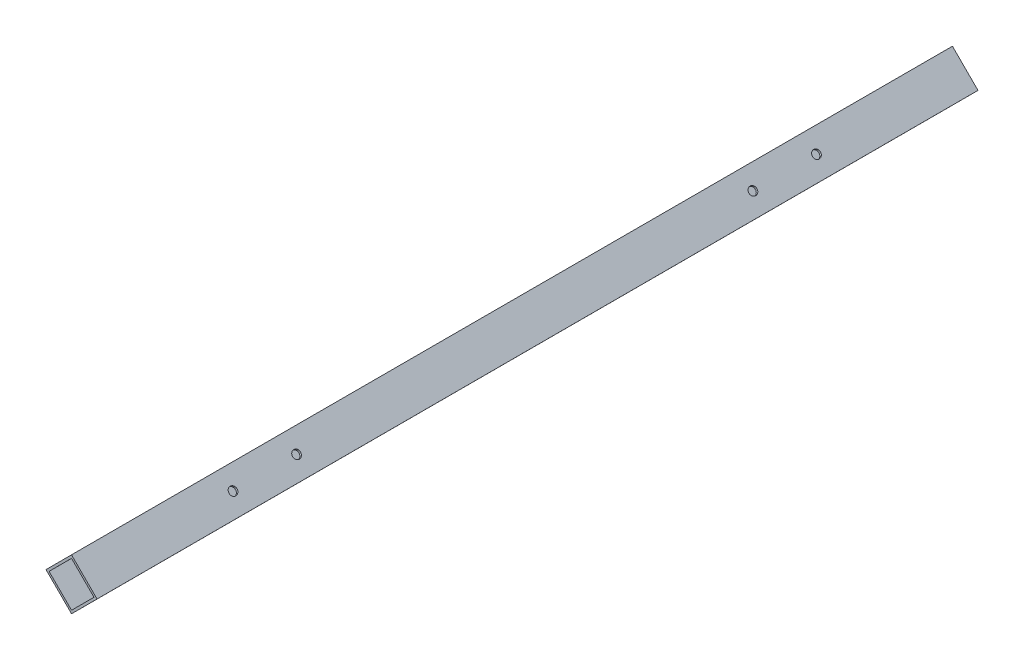
ISO-10303-21;
HEADER;
FILE_DESCRIPTION(('STEP AP214'),'2;1');
FILE_NAME('part.step','',(''),(''),'','','');
FILE_SCHEMA(('AUTOMOTIVE_DESIGN { 1 0 10303 214 1 1 1 1 }'));
ENDSEC;
DATA;
#1=APPLICATION_CONTEXT('core data for automotive mechanical design processes');
#2=APPLICATION_PROTOCOL_DEFINITION('international standard','automotive_design',2000,#1);
#3=PRODUCT_CONTEXT('',#1,'mechanical');
#4=PRODUCT('Part','Part','',(#3));
#5=PRODUCT_RELATED_PRODUCT_CATEGORY('part','',(#4));
#6=PRODUCT_DEFINITION_FORMATION('','',#4);
#7=PRODUCT_DEFINITION_CONTEXT('part definition',#1,'design');
#8=PRODUCT_DEFINITION('design','',#6,#7);
#9=PRODUCT_DEFINITION_SHAPE('','',#8);
#10=(LENGTH_UNIT() NAMED_UNIT(*) SI_UNIT(.MILLI.,.METRE.));
#11=(NAMED_UNIT(*) PLANE_ANGLE_UNIT() SI_UNIT($,.RADIAN.));
#12=(NAMED_UNIT(*) SI_UNIT($,.STERADIAN.) SOLID_ANGLE_UNIT());
#13=UNCERTAINTY_MEASURE_WITH_UNIT(LENGTH_MEASURE(1.E-05),#10,'distance_accuracy_value','');
#14=(GEOMETRIC_REPRESENTATION_CONTEXT(3) GLOBAL_UNCERTAINTY_ASSIGNED_CONTEXT((#13)) GLOBAL_UNIT_ASSIGNED_CONTEXT((#10,
#11,#12)) REPRESENTATION_CONTEXT('',''));
#15=CARTESIAN_POINT('',(0.,0.,0.));
#16=DIRECTION('',(0.,0.,1.));
#17=DIRECTION('',(1.,0.,0.));
#18=AXIS2_PLACEMENT_3D('',#15,#16,#17);
#19=CARTESIAN_POINT('',(0.,0.,610.));
#20=DIRECTION('',(0.,0.,1.));
#21=DIRECTION('',(1.,0.,0.));
#22=AXIS2_PLACEMENT_3D('',#19,#20,#21);
#23=PLANE('',#22);
#24=DIRECTION('',(-0.70646122875546,-0.707751744798503,0.));
#25=VECTOR('',#24,1.);
#26=CARTESIAN_POINT('',(0.,0.,610.));
#27=LINE('',#26,#25);
#28=CARTESIAN_POINT('',(0.,0.,610.));
#29=VERTEX_POINT('',#28);
#30=CARTESIAN_POINT('',(-17.6615307188865,-17.6937936199626,610.));
#31=VERTEX_POINT('',#30);
#32=EDGE_CURVE('E139',#29,#31,#27,.T.);
#33=ORIENTED_EDGE('',*,*,#32,.T.);
#34=DIRECTION('',(0.707751744798503,-0.70646122875546,0.));
#35=VECTOR('',#34,1.);
#36=CARTESIAN_POINT('',(-17.6615307188865,-17.6937936199626,610.));
#37=LINE('',#36,#35);
#38=CARTESIAN_POINT('',(0.0322629010760627,-35.3553243388491,610.));
#39=VERTEX_POINT('',#38);
#40=EDGE_CURVE('E142',#31,#39,#37,.T.);
#41=ORIENTED_EDGE('',*,*,#40,.T.);
#42=DIRECTION('',(0.70646122875546,0.707751744798503,0.));
#43=VECTOR('',#42,1.);
#44=CARTESIAN_POINT('',(17.6937936199626,-17.6615307188865,610.));
#45=LINE('',#44,#43);
#46=CARTESIAN_POINT('',(17.6937936199626,-17.6615307188865,610.));
#47=VERTEX_POINT('',#46);
#48=EDGE_CURVE('E145',#39,#47,#45,.T.);
#49=ORIENTED_EDGE('',*,*,#48,.T.);
#50=DIRECTION('',(-0.707751744798503,0.70646122875546,0.));
#51=VECTOR('',#50,1.);
#52=CARTESIAN_POINT('',(0.,0.,610.));
#53=LINE('',#52,#51);
#54=EDGE_CURVE('E147',#47,#29,#53,.T.);
#55=ORIENTED_EDGE('',*,*,#54,.T.);
#56=EDGE_LOOP('',(#33,#41,#49,#55));
#57=FACE_BOUND('',#56,.T.);
#58=DIRECTION('',(-0.706461228755461,-0.707751744798503,0.));
#59=VECTOR('',#58,1.);
#60=CARTESIAN_POINT('',(0.00193577406456353,-2.12131946033095,610.));
#61=LINE('',#60,#59);
#62=CARTESIAN_POINT('',(0.00193577406456353,-2.12131946033095,610.));
#63=VERTEX_POINT('',#62);
#64=CARTESIAN_POINT('',(-15.5402112585556,-17.691857845898,610.));
#65=VERTEX_POINT('',#64);
#66=EDGE_CURVE('E109',#63,#65,#61,.T.);
#67=ORIENTED_EDGE('',*,*,#66,.F.);
#68=DIRECTION('',(-0.707751744798503,0.70646122875546,0.));
#69=VECTOR('',#68,1.);
#70=CARTESIAN_POINT('',(0.00193577406456353,-2.12131946033095,610.));
#71=LINE('',#70,#69);
#72=CARTESIAN_POINT('',(15.5724741596316,-17.6634664929511,610.));
#73=VERTEX_POINT('',#72);
#74=EDGE_CURVE('E101',#73,#63,#71,.T.);
#75=ORIENTED_EDGE('',*,*,#74,.F.);
#76=DIRECTION('',(0.70646122875546,0.707751744798503,0.));
#77=VECTOR('',#76,1.);
#78=CARTESIAN_POINT('',(15.5724741596316,-17.6634664929511,610.));
#79=LINE('',#78,#77);
#80=CARTESIAN_POINT('',(0.0303271270114952,-33.2340048785181,610.));
#81=VERTEX_POINT('',#80);
#82=EDGE_CURVE('E123',#81,#73,#79,.T.);
#83=ORIENTED_EDGE('',*,*,#82,.F.);
#84=DIRECTION('',(0.707751744798503,-0.70646122875546,0.));
#85=VECTOR('',#84,1.);
#86=CARTESIAN_POINT('',(-15.5402112585556,-17.691857845898,610.));
#87=LINE('',#86,#85);
#88=EDGE_CURVE('E121',#65,#81,#87,.T.);
#89=ORIENTED_EDGE('',*,*,#88,.F.);
#90=EDGE_LOOP('',(#67,#75,#83,#89));
#91=FACE_BOUND('',#90,.T.);
#92=ADVANCED_FACE('F34',(#57,#91),#23,.T.);
#93=CARTESIAN_POINT('',(0.,0.,0.));
#94=DIRECTION('',(0.,0.,1.));
#95=DIRECTION('',(1.,0.,0.));
#96=AXIS2_PLACEMENT_3D('',#93,#94,#95);
#97=PLANE('',#96);
#98=DIRECTION('',(-0.70646122875546,-0.707751744798503,0.));
#99=VECTOR('',#98,1.);
#100=CARTESIAN_POINT('',(0.,0.,0.));
#101=LINE('',#100,#99);
#102=CARTESIAN_POINT('',(0.,0.,0.));
#103=VERTEX_POINT('',#102);
#104=CARTESIAN_POINT('',(-17.6615307188865,-17.6937936199626,0.));
#105=VERTEX_POINT('',#104);
#106=EDGE_CURVE('E117',#103,#105,#101,.T.);
#107=ORIENTED_EDGE('',*,*,#106,.F.);
#108=DIRECTION('',(-0.707751744798503,0.70646122875546,0.));
#109=VECTOR('',#108,1.);
#110=CARTESIAN_POINT('',(0.,0.,0.));
#111=LINE('',#110,#109);
#112=CARTESIAN_POINT('',(17.6937936199626,-17.6615307188865,0.));
#113=VERTEX_POINT('',#112);
#114=EDGE_CURVE('E143',#113,#103,#111,.T.);
#115=ORIENTED_EDGE('',*,*,#114,.F.);
#116=DIRECTION('',(0.70646122875546,0.707751744798503,0.));
#117=VECTOR('',#116,1.);
#118=CARTESIAN_POINT('',(17.6937936199626,-17.6615307188865,0.));
#119=LINE('',#118,#117);
#120=CARTESIAN_POINT('',(0.0322629010760627,-35.3553243388491,0.));
#121=VERTEX_POINT('',#120);
#122=EDGE_CURVE('E154',#121,#113,#119,.T.);
#123=ORIENTED_EDGE('',*,*,#122,.F.);
#124=DIRECTION('',(0.707751744798503,-0.70646122875546,0.));
#125=VECTOR('',#124,1.);
#126=CARTESIAN_POINT('',(-17.6615307188865,-17.6937936199626,0.));
#127=LINE('',#126,#125);
#128=EDGE_CURVE('E152',#105,#121,#127,.T.);
#129=ORIENTED_EDGE('',*,*,#128,.F.);
#130=EDGE_LOOP('',(#107,#115,#123,#129));
#131=FACE_BOUND('',#130,.T.);
#132=DIRECTION('',(-0.707751744798503,0.70646122875546,0.));
#133=VECTOR('',#132,1.);
#134=CARTESIAN_POINT('',(0.00193577406456353,-2.12131946033095,0.));
#135=LINE('',#134,#133);
#136=CARTESIAN_POINT('',(15.5724741596316,-17.6634664929511,0.));
#137=VERTEX_POINT('',#136);
#138=CARTESIAN_POINT('',(0.00193577406456353,-2.12131946033095,0.));
#139=VERTEX_POINT('',#138);
#140=EDGE_CURVE('E59',#137,#139,#135,.T.);
#141=ORIENTED_EDGE('',*,*,#140,.T.);
#142=DIRECTION('',(-0.706461228755461,-0.707751744798503,0.));
#143=VECTOR('',#142,1.);
#144=CARTESIAN_POINT('',(0.00193577406456353,-2.12131946033095,0.));
#145=LINE('',#144,#143);
#146=CARTESIAN_POINT('',(-15.5402112585556,-17.691857845898,0.));
#147=VERTEX_POINT('',#146);
#148=EDGE_CURVE('E116',#139,#147,#145,.T.);
#149=ORIENTED_EDGE('',*,*,#148,.T.);
#150=DIRECTION('',(0.707751744798503,-0.70646122875546,0.));
#151=VECTOR('',#150,1.);
#152=CARTESIAN_POINT('',(-15.5402112585556,-17.691857845898,0.));
#153=LINE('',#152,#151);
#154=CARTESIAN_POINT('',(0.0303271270114987,-33.2340048785181,0.));
#155=VERTEX_POINT('',#154);
#156=EDGE_CURVE('E131',#147,#155,#153,.T.);
#157=ORIENTED_EDGE('',*,*,#156,.T.);
#158=DIRECTION('',(0.70646122875546,0.707751744798503,0.));
#159=VECTOR('',#158,1.);
#160=CARTESIAN_POINT('',(15.5724741596316,-17.6634664929511,0.));
#161=LINE('',#160,#159);
#162=EDGE_CURVE('E110',#155,#137,#161,.T.);
#163=ORIENTED_EDGE('',*,*,#162,.T.);
#164=EDGE_LOOP('',(#141,#149,#157,#163));
#165=FACE_BOUND('',#164,.T.);
#166=ADVANCED_FACE('F223',(#131,#165),#97,.F.);
#167=CARTESIAN_POINT('',(0.,0.,610.));
#168=DIRECTION('',(0.707751744798503,-0.70646122875546,0.));
#169=DIRECTION('',(0.70646122875546,0.707751744798503,0.));
#170=AXIS2_PLACEMENT_3D('',#167,#168,#169);
#171=PLANE('',#170);
#172=ORIENTED_EDGE('',*,*,#106,.T.);
#173=DIRECTION('',(0.,0.,-1.));
#174=VECTOR('',#173,1.);
#175=CARTESIAN_POINT('',(-17.6615307188865,-17.6937936199626,610.));
#176=LINE('',#175,#174);
#177=EDGE_CURVE('E11',#31,#105,#176,.T.);
#178=ORIENTED_EDGE('',*,*,#177,.F.);
#179=ORIENTED_EDGE('',*,*,#32,.F.);
#180=DIRECTION('',(0.,0.,-1.));
#181=VECTOR('',#180,1.);
#182=CARTESIAN_POINT('',(0.,0.,610.));
#183=LINE('',#182,#181);
#184=EDGE_CURVE('E149',#29,#103,#183,.T.);
#185=ORIENTED_EDGE('',*,*,#184,.T.);
#186=EDGE_LOOP('',(#172,#178,#179,#185));
#187=FACE_BOUND('',#186,.T.);
#188=ADVANCED_FACE('F36',(#187),#171,.F.);
#189=CARTESIAN_POINT('',(-17.6615307188865,-17.6937936199626,610.));
#190=DIRECTION('',(0.70646122875546,0.707751744798503,0.));
#191=DIRECTION('',(-0.707751744798503,0.70646122875546,0.));
#192=AXIS2_PLACEMENT_3D('',#189,#190,#191);
#193=PLANE('',#192);
#194=CARTESIAN_POINT('',(-8.81463390890522,-26.5245589794058,507.));
#195=DIRECTION('',(0.70646122875546,0.707751744798503,0.));
#196=DIRECTION('',(-0.707751744798503,0.70646122875546,0.));
#197=AXIS2_PLACEMENT_3D('',#194,#195,#196);
#198=CIRCLE('',#197,2.74999999999995);
#199=CARTESIAN_POINT('',(-10.7609512071011,-24.5817906003283,507.));
#200=VERTEX_POINT('',#199);
#201=EDGE_CURVE('E129',#200,#200,#198,.T.);
#202=ORIENTED_EDGE('',*,*,#201,.T.);
#203=EDGE_LOOP('',(#202));
#204=FACE_BOUND('',#203,.T.);
#205=CARTESIAN_POINT('',(-8.81463390890523,-26.5245589794058,103.));
#206=DIRECTION('',(0.70646122875546,0.707751744798503,0.));
#207=DIRECTION('',(-0.707751744798503,0.70646122875546,0.));
#208=AXIS2_PLACEMENT_3D('',#205,#206,#207);
#209=CIRCLE('',#208,2.75);
#210=CARTESIAN_POINT('',(-10.7609512071011,-24.5817906003283,103.));
#211=VERTEX_POINT('',#210);
#212=EDGE_CURVE('E180',#211,#211,#209,.T.);
#213=ORIENTED_EDGE('',*,*,#212,.T.);
#214=EDGE_LOOP('',(#213));
#215=FACE_BOUND('',#214,.T.);
#216=CARTESIAN_POINT('',(-8.81463390890523,-26.5245589794058,147.));
#217=DIRECTION('',(0.70646122875546,0.707751744798503,0.));
#218=DIRECTION('',(-0.707751744798503,0.70646122875546,0.));
#219=AXIS2_PLACEMENT_3D('',#216,#217,#218);
#220=CIRCLE('',#219,2.75);
#221=CARTESIAN_POINT('',(-10.7609512071011,-24.5817906003283,147.));
#222=VERTEX_POINT('',#221);
#223=EDGE_CURVE('E176',#222,#222,#220,.T.);
#224=ORIENTED_EDGE('',*,*,#223,.T.);
#225=EDGE_LOOP('',(#224));
#226=FACE_BOUND('',#225,.T.);
#227=CARTESIAN_POINT('',(-8.81463390890522,-26.5245589794058,463.));
#228=DIRECTION('',(0.70646122875546,0.707751744798503,0.));
#229=DIRECTION('',(-0.707751744798503,0.70646122875546,0.));
#230=AXIS2_PLACEMENT_3D('',#227,#228,#229);
#231=CIRCLE('',#230,2.75);
#232=CARTESIAN_POINT('',(-10.7609512071011,-24.5817906003283,463.));
#233=VERTEX_POINT('',#232);
#234=EDGE_CURVE('E172',#233,#233,#231,.T.);
#235=ORIENTED_EDGE('',*,*,#234,.T.);
#236=EDGE_LOOP('',(#235));
#237=FACE_BOUND('',#236,.T.);
#238=ORIENTED_EDGE('',*,*,#128,.T.);
#239=DIRECTION('',(0.,0.,-1.));
#240=VECTOR('',#239,1.);
#241=CARTESIAN_POINT('',(0.0322629010760627,-35.3553243388491,610.));
#242=LINE('',#241,#240);
#243=EDGE_CURVE('E43',#39,#121,#242,.T.);
#244=ORIENTED_EDGE('',*,*,#243,.F.);
#245=ORIENTED_EDGE('',*,*,#40,.F.);
#246=ORIENTED_EDGE('',*,*,#177,.T.);
#247=EDGE_LOOP('',(#238,#244,#245,#246));
#248=FACE_BOUND('',#247,.T.);
#249=ADVANCED_FACE('F197',(#204,#215,#226,#237,#248),#193,.F.);
#250=CARTESIAN_POINT('',(17.6937936199626,-17.6615307188865,610.));
#251=DIRECTION('',(-0.707751744798503,0.70646122875546,0.));
#252=DIRECTION('',(-0.70646122875546,-0.707751744798503,0.));
#253=AXIS2_PLACEMENT_3D('',#250,#251,#252);
#254=PLANE('',#253);
#255=ORIENTED_EDGE('',*,*,#122,.T.);
#256=DIRECTION('',(0.,0.,-1.));
#257=VECTOR('',#256,1.);
#258=CARTESIAN_POINT('',(17.6937936199626,-17.6615307188865,610.));
#259=LINE('',#258,#257);
#260=EDGE_CURVE('E159',#47,#113,#259,.T.);
#261=ORIENTED_EDGE('',*,*,#260,.F.);
#262=ORIENTED_EDGE('',*,*,#48,.F.);
#263=ORIENTED_EDGE('',*,*,#243,.T.);
#264=EDGE_LOOP('',(#255,#261,#262,#263));
#265=FACE_BOUND('',#264,.T.);
#266=ADVANCED_FACE('F237',(#265),#254,.F.);
#267=CARTESIAN_POINT('',(0.,0.,610.));
#268=DIRECTION('',(-0.70646122875546,-0.707751744798503,0.));
#269=DIRECTION('',(0.707751744798503,-0.70646122875546,0.));
#270=AXIS2_PLACEMENT_3D('',#267,#268,#269);
#271=PLANE('',#270);
#272=CARTESIAN_POINT('',(8.84689680998128,-8.83076535944326,507.));
#273=DIRECTION('',(0.706461228755461,0.707751744798503,0.));
#274=DIRECTION('',(-0.707751744798503,0.706461228755461,0.));
#275=AXIS2_PLACEMENT_3D('',#272,#273,#274);
#276=CIRCLE('',#275,2.74999999999995);
#277=CARTESIAN_POINT('',(6.90057951178544,-6.88799698036578,507.));
#278=VERTEX_POINT('',#277);
#279=EDGE_CURVE('E293',#278,#278,#276,.T.);
#280=ORIENTED_EDGE('',*,*,#279,.F.);
#281=EDGE_LOOP('',(#280));
#282=FACE_BOUND('',#281,.T.);
#283=CARTESIAN_POINT('',(8.84689680998128,-8.83076535944326,103.));
#284=DIRECTION('',(0.706461228755461,0.707751744798503,0.));
#285=DIRECTION('',(-0.707751744798503,0.706461228755461,0.));
#286=AXIS2_PLACEMENT_3D('',#283,#284,#285);
#287=CIRCLE('',#286,2.75);
#288=CARTESIAN_POINT('',(6.9005795117854,-6.88799698036574,103.));
#289=VERTEX_POINT('',#288);
#290=EDGE_CURVE('E294',#289,#289,#287,.T.);
#291=ORIENTED_EDGE('',*,*,#290,.F.);
#292=EDGE_LOOP('',(#291));
#293=FACE_BOUND('',#292,.T.);
#294=CARTESIAN_POINT('',(8.84689680998128,-8.83076535944326,147.));
#295=DIRECTION('',(0.706461228755461,0.707751744798503,0.));
#296=DIRECTION('',(-0.707751744798503,0.706461228755461,0.));
#297=AXIS2_PLACEMENT_3D('',#294,#295,#296);
#298=CIRCLE('',#297,2.75);
#299=CARTESIAN_POINT('',(6.9005795117854,-6.88799698036574,147.));
#300=VERTEX_POINT('',#299);
#301=EDGE_CURVE('E297',#300,#300,#298,.T.);
#302=ORIENTED_EDGE('',*,*,#301,.F.);
#303=EDGE_LOOP('',(#302));
#304=FACE_BOUND('',#303,.T.);
#305=CARTESIAN_POINT('',(8.84689680998128,-8.83076535944326,463.));
#306=DIRECTION('',(0.706461228755461,0.707751744798503,0.));
#307=DIRECTION('',(-0.707751744798503,0.706461228755461,0.));
#308=AXIS2_PLACEMENT_3D('',#305,#306,#307);
#309=CIRCLE('',#308,2.75);
#310=CARTESIAN_POINT('',(6.9005795117854,-6.88799698036574,463.));
#311=VERTEX_POINT('',#310);
#312=EDGE_CURVE('E168',#311,#311,#309,.T.);
#313=ORIENTED_EDGE('',*,*,#312,.F.);
#314=EDGE_LOOP('',(#313));
#315=FACE_BOUND('',#314,.T.);
#316=ORIENTED_EDGE('',*,*,#114,.T.);
#317=ORIENTED_EDGE('',*,*,#184,.F.);
#318=ORIENTED_EDGE('',*,*,#54,.F.);
#319=ORIENTED_EDGE('',*,*,#260,.T.);
#320=EDGE_LOOP('',(#316,#317,#318,#319));
#321=FACE_BOUND('',#320,.T.);
#322=ADVANCED_FACE('F234',(#282,#293,#304,#315,#321),#271,.F.);
#323=CARTESIAN_POINT('',(0.00193577406456353,-2.12131946033095,610.));
#324=DIRECTION('',(-0.70646122875546,-0.707751744798503,0.));
#325=DIRECTION('',(0.707751744798503,-0.70646122875546,0.));
#326=AXIS2_PLACEMENT_3D('',#323,#324,#325);
#327=PLANE('',#326);
#328=CARTESIAN_POINT('',(7.7872049668481,-9.89239297664101,507.));
#329=DIRECTION('',(-0.70646122875546,-0.707751744798503,0.));
#330=DIRECTION('',(0.707751744798503,-0.70646122875546,0.));
#331=AXIS2_PLACEMENT_3D('',#328,#329,#330);
#332=CIRCLE('',#331,2.74999999999995);
#333=CARTESIAN_POINT('',(9.73352226504395,-11.8351613557185,507.));
#334=VERTEX_POINT('',#333);
#335=EDGE_CURVE('E192',#334,#334,#332,.T.);
#336=ORIENTED_EDGE('',*,*,#335,.F.);
#337=EDGE_LOOP('',(#336));
#338=FACE_BOUND('',#337,.T.);
#339=CARTESIAN_POINT('',(7.7872049668481,-9.892392976641,103.));
#340=DIRECTION('',(-0.70646122875546,-0.707751744798503,0.));
#341=DIRECTION('',(0.707751744798503,-0.70646122875546,0.));
#342=AXIS2_PLACEMENT_3D('',#339,#340,#341);
#343=CIRCLE('',#342,2.75);
#344=CARTESIAN_POINT('',(9.73352226504398,-11.8351613557185,103.));
#345=VERTEX_POINT('',#344);
#346=EDGE_CURVE('E175',#345,#345,#343,.T.);
#347=ORIENTED_EDGE('',*,*,#346,.F.);
#348=EDGE_LOOP('',(#347));
#349=FACE_BOUND('',#348,.T.);
#350=CARTESIAN_POINT('',(7.7872049668481,-9.892392976641,147.));
#351=DIRECTION('',(-0.70646122875546,-0.707751744798503,0.));
#352=DIRECTION('',(0.707751744798503,-0.70646122875546,0.));
#353=AXIS2_PLACEMENT_3D('',#350,#351,#352);
#354=CIRCLE('',#353,2.75);
#355=CARTESIAN_POINT('',(9.73352226504398,-11.8351613557185,147.));
#356=VERTEX_POINT('',#355);
#357=EDGE_CURVE('E171',#356,#356,#354,.T.);
#358=ORIENTED_EDGE('',*,*,#357,.F.);
#359=EDGE_LOOP('',(#358));
#360=FACE_BOUND('',#359,.T.);
#361=CARTESIAN_POINT('',(7.7872049668481,-9.89239297664101,463.));
#362=DIRECTION('',(-0.70646122875546,-0.707751744798503,0.));
#363=DIRECTION('',(0.707751744798503,-0.70646122875546,0.));
#364=AXIS2_PLACEMENT_3D('',#361,#362,#363);
#365=CIRCLE('',#364,2.75);
#366=CARTESIAN_POINT('',(9.73352226504398,-11.8351613557185,463.));
#367=VERTEX_POINT('',#366);
#368=EDGE_CURVE('E167',#367,#367,#365,.T.);
#369=ORIENTED_EDGE('',*,*,#368,.F.);
#370=EDGE_LOOP('',(#369));
#371=FACE_BOUND('',#370,.T.);
#372=ORIENTED_EDGE('',*,*,#140,.F.);
#373=DIRECTION('',(0.,0.,-1.));
#374=VECTOR('',#373,1.);
#375=CARTESIAN_POINT('',(15.5724741596316,-17.6634664929511,610.));
#376=LINE('',#375,#374);
#377=EDGE_CURVE('E105',#73,#137,#376,.T.);
#378=ORIENTED_EDGE('',*,*,#377,.F.);
#379=ORIENTED_EDGE('',*,*,#74,.T.);
#380=DIRECTION('',(0.,0.,-1.));
#381=VECTOR('',#380,1.);
#382=CARTESIAN_POINT('',(0.00193577406456353,-2.12131946033095,610.));
#383=LINE('',#382,#381);
#384=EDGE_CURVE('E104',#63,#139,#383,.T.);
#385=ORIENTED_EDGE('',*,*,#384,.T.);
#386=EDGE_LOOP('',(#372,#378,#379,#385));
#387=FACE_BOUND('',#386,.T.);
#388=ADVANCED_FACE('F103',(#338,#349,#360,#371,#387),#327,.T.);
#389=CARTESIAN_POINT('',(0.00193577406456353,-2.12131946033095,610.));
#390=DIRECTION('',(0.707751744798503,-0.706461228755461,0.));
#391=DIRECTION('',(0.706461228755461,0.707751744798503,0.));
#392=AXIS2_PLACEMENT_3D('',#389,#390,#391);
#393=PLANE('',#392);
#394=ORIENTED_EDGE('',*,*,#148,.F.);
#395=ORIENTED_EDGE('',*,*,#384,.F.);
#396=ORIENTED_EDGE('',*,*,#66,.T.);
#397=DIRECTION('',(0.,0.,-1.));
#398=VECTOR('',#397,1.);
#399=CARTESIAN_POINT('',(-15.5402112585556,-17.691857845898,610.));
#400=LINE('',#399,#398);
#401=EDGE_CURVE('E118',#65,#147,#400,.T.);
#402=ORIENTED_EDGE('',*,*,#401,.T.);
#403=EDGE_LOOP('',(#394,#395,#396,#402));
#404=FACE_BOUND('',#403,.T.);
#405=ADVANCED_FACE('F113',(#404),#393,.T.);
#406=CARTESIAN_POINT('',(-15.5402112585556,-17.691857845898,610.));
#407=DIRECTION('',(0.70646122875546,0.707751744798503,0.));
#408=DIRECTION('',(-0.707751744798503,0.70646122875546,0.));
#409=AXIS2_PLACEMENT_3D('',#406,#407,#408);
#410=PLANE('',#409);
#411=CARTESIAN_POINT('',(-7.75494206577203,-25.4629313622081,507.));
#412=DIRECTION('',(0.70646122875546,0.707751744798503,0.));
#413=DIRECTION('',(-0.707751744798503,0.70646122875546,0.));
#414=AXIS2_PLACEMENT_3D('',#411,#412,#413);
#415=CIRCLE('',#414,2.74999999999995);
#416=CARTESIAN_POINT('',(-9.70125936396788,-23.5201629831306,507.));
#417=VERTEX_POINT('',#416);
#418=EDGE_CURVE('E38',#417,#417,#415,.T.);
#419=ORIENTED_EDGE('',*,*,#418,.F.);
#420=EDGE_LOOP('',(#419));
#421=FACE_BOUND('',#420,.T.);
#422=CARTESIAN_POINT('',(-7.75494206577204,-25.4629313622081,103.));
#423=DIRECTION('',(0.70646122875546,0.707751744798503,0.));
#424=DIRECTION('',(-0.707751744798503,0.70646122875546,0.));
#425=AXIS2_PLACEMENT_3D('',#422,#423,#424);
#426=CIRCLE('',#425,2.75);
#427=CARTESIAN_POINT('',(-9.70125936396792,-23.5201629831306,103.));
#428=VERTEX_POINT('',#427);
#429=EDGE_CURVE('E173',#428,#428,#426,.T.);
#430=ORIENTED_EDGE('',*,*,#429,.F.);
#431=EDGE_LOOP('',(#430));
#432=FACE_BOUND('',#431,.T.);
#433=CARTESIAN_POINT('',(-7.75494206577204,-25.4629313622081,147.));
#434=DIRECTION('',(0.70646122875546,0.707751744798503,0.));
#435=DIRECTION('',(-0.707751744798503,0.70646122875546,0.));
#436=AXIS2_PLACEMENT_3D('',#433,#434,#435);
#437=CIRCLE('',#436,2.75);
#438=CARTESIAN_POINT('',(-9.70125936396792,-23.5201629831306,147.));
#439=VERTEX_POINT('',#438);
#440=EDGE_CURVE('E169',#439,#439,#437,.T.);
#441=ORIENTED_EDGE('',*,*,#440,.F.);
#442=EDGE_LOOP('',(#441));
#443=FACE_BOUND('',#442,.T.);
#444=CARTESIAN_POINT('',(-7.75494206577203,-25.4629313622081,463.));
#445=DIRECTION('',(0.70646122875546,0.707751744798503,0.));
#446=DIRECTION('',(-0.707751744798503,0.70646122875546,0.));
#447=AXIS2_PLACEMENT_3D('',#444,#445,#446);
#448=CIRCLE('',#447,2.75);
#449=CARTESIAN_POINT('',(-9.70125936396792,-23.5201629831306,463.));
#450=VERTEX_POINT('',#449);
#451=EDGE_CURVE('E164',#450,#450,#448,.T.);
#452=ORIENTED_EDGE('',*,*,#451,.F.);
#453=EDGE_LOOP('',(#452));
#454=FACE_BOUND('',#453,.T.);
#455=ORIENTED_EDGE('',*,*,#156,.F.);
#456=ORIENTED_EDGE('',*,*,#401,.F.);
#457=ORIENTED_EDGE('',*,*,#88,.T.);
#458=DIRECTION('',(0.,0.,-1.));
#459=VECTOR('',#458,1.);
#460=CARTESIAN_POINT('',(0.0303271270114987,-33.2340048785181,610.));
#461=LINE('',#460,#459);
#462=EDGE_CURVE('E51',#81,#155,#461,.T.);
#463=ORIENTED_EDGE('',*,*,#462,.T.);
#464=EDGE_LOOP('',(#455,#456,#457,#463));
#465=FACE_BOUND('',#464,.T.);
#466=ADVANCED_FACE('F264',(#421,#432,#443,#454,#465),#410,.T.);
#467=CARTESIAN_POINT('',(15.5724741596316,-17.6634664929511,610.));
#468=DIRECTION('',(-0.707751744798503,0.70646122875546,0.));
#469=DIRECTION('',(-0.70646122875546,-0.707751744798503,0.));
#470=AXIS2_PLACEMENT_3D('',#467,#468,#469);
#471=PLANE('',#470);
#472=ORIENTED_EDGE('',*,*,#162,.F.);
#473=ORIENTED_EDGE('',*,*,#462,.F.);
#474=ORIENTED_EDGE('',*,*,#82,.T.);
#475=ORIENTED_EDGE('',*,*,#377,.T.);
#476=EDGE_LOOP('',(#472,#473,#474,#475));
#477=FACE_BOUND('',#476,.T.);
#478=ADVANCED_FACE('F262',(#477),#471,.T.);
#479=CARTESIAN_POINT('',(-17.6453845613123,-35.3714410554851,463.));
#480=DIRECTION('',(0.70646122875546,0.707751744798503,0.));
#481=DIRECTION('',(-0.707751744798503,0.706461228755461,0.));
#482=AXIS2_PLACEMENT_3D('',#479,#480,#481);
#483=CYLINDRICAL_SURFACE('',#482,2.75);
#484=ORIENTED_EDGE('',*,*,#451,.T.);
#485=EDGE_LOOP('',(#484));
#486=FACE_BOUND('',#485,.T.);
#487=ORIENTED_EDGE('',*,*,#234,.F.);
#488=EDGE_LOOP('',(#487));
#489=FACE_BOUND('',#488,.T.);
#490=ADVANCED_FACE('F214',(#486,#489),#483,.F.);
#491=CARTESIAN_POINT('',(-17.6453845613123,-35.3714410554851,147.));
#492=DIRECTION('',(0.70646122875546,0.707751744798503,0.));
#493=DIRECTION('',(-0.707751744798503,0.706461228755461,0.));
#494=AXIS2_PLACEMENT_3D('',#491,#492,#493);
#495=CYLINDRICAL_SURFACE('',#494,2.75);
#496=ORIENTED_EDGE('',*,*,#440,.T.);
#497=EDGE_LOOP('',(#496));
#498=FACE_BOUND('',#497,.T.);
#499=ORIENTED_EDGE('',*,*,#223,.F.);
#500=EDGE_LOOP('',(#499));
#501=FACE_BOUND('',#500,.T.);
#502=ADVANCED_FACE('F215',(#498,#501),#495,.F.);
#503=CARTESIAN_POINT('',(-17.6453845613123,-35.3714410554851,103.));
#504=DIRECTION('',(0.70646122875546,0.707751744798503,0.));
#505=DIRECTION('',(-0.707751744798503,0.706461228755461,0.));
#506=AXIS2_PLACEMENT_3D('',#503,#504,#505);
#507=CYLINDRICAL_SURFACE('',#506,2.75);
#508=ORIENTED_EDGE('',*,*,#429,.T.);
#509=EDGE_LOOP('',(#508));
#510=FACE_BOUND('',#509,.T.);
#511=ORIENTED_EDGE('',*,*,#212,.F.);
#512=EDGE_LOOP('',(#511));
#513=FACE_BOUND('',#512,.T.);
#514=ADVANCED_FACE('F203',(#510,#513),#507,.F.);
#515=CARTESIAN_POINT('',(-17.6453845613123,-35.3714410554851,507.));
#516=DIRECTION('',(0.70646122875546,0.707751744798503,0.));
#517=DIRECTION('',(-0.707751744798503,0.706461228755461,0.));
#518=AXIS2_PLACEMENT_3D('',#515,#516,#517);
#519=CYLINDRICAL_SURFACE('',#518,2.74999999999995);
#520=ORIENTED_EDGE('',*,*,#418,.T.);
#521=EDGE_LOOP('',(#520));
#522=FACE_BOUND('',#521,.T.);
#523=ORIENTED_EDGE('',*,*,#201,.F.);
#524=EDGE_LOOP('',(#523));
#525=FACE_BOUND('',#524,.T.);
#526=ADVANCED_FACE('F200',(#522,#525),#519,.F.);
#527=ORIENTED_EDGE('',*,*,#368,.T.);
#528=EDGE_LOOP('',(#527));
#529=FACE_BOUND('',#528,.T.);
#530=ORIENTED_EDGE('',*,*,#312,.T.);
#531=EDGE_LOOP('',(#530));
#532=FACE_BOUND('',#531,.T.);
#533=ADVANCED_FACE('F202',(#529,#532),#483,.F.);
#534=ORIENTED_EDGE('',*,*,#357,.T.);
#535=EDGE_LOOP('',(#534));
#536=FACE_BOUND('',#535,.T.);
#537=ORIENTED_EDGE('',*,*,#301,.T.);
#538=EDGE_LOOP('',(#537));
#539=FACE_BOUND('',#538,.T.);
#540=ADVANCED_FACE('F211',(#536,#539),#495,.F.);
#541=ORIENTED_EDGE('',*,*,#346,.T.);
#542=EDGE_LOOP('',(#541));
#543=FACE_BOUND('',#542,.T.);
#544=ORIENTED_EDGE('',*,*,#290,.T.);
#545=EDGE_LOOP('',(#544));
#546=FACE_BOUND('',#545,.T.);
#547=ADVANCED_FACE('F217',(#543,#546),#507,.F.);
#548=ORIENTED_EDGE('',*,*,#335,.T.);
#549=EDGE_LOOP('',(#548));
#550=FACE_BOUND('',#549,.T.);
#551=ORIENTED_EDGE('',*,*,#279,.T.);
#552=EDGE_LOOP('',(#551));
#553=FACE_BOUND('',#552,.T.);
#554=ADVANCED_FACE('F206',(#550,#553),#519,.F.);
#555=CLOSED_SHELL('',(#92,#166,#188,#249,#266,#322,#388,#405,#466,#478,#490,#502,#514,#526,#533,
#540,#547,#554));
#556=MANIFOLD_SOLID_BREP('B2',#555);
#557=ADVANCED_BREP_SHAPE_REPRESENTATION('',(#18,#556),#14);
#558=SHAPE_DEFINITION_REPRESENTATION(#9,#557);
ENDSEC;
END-ISO-10303-21;
